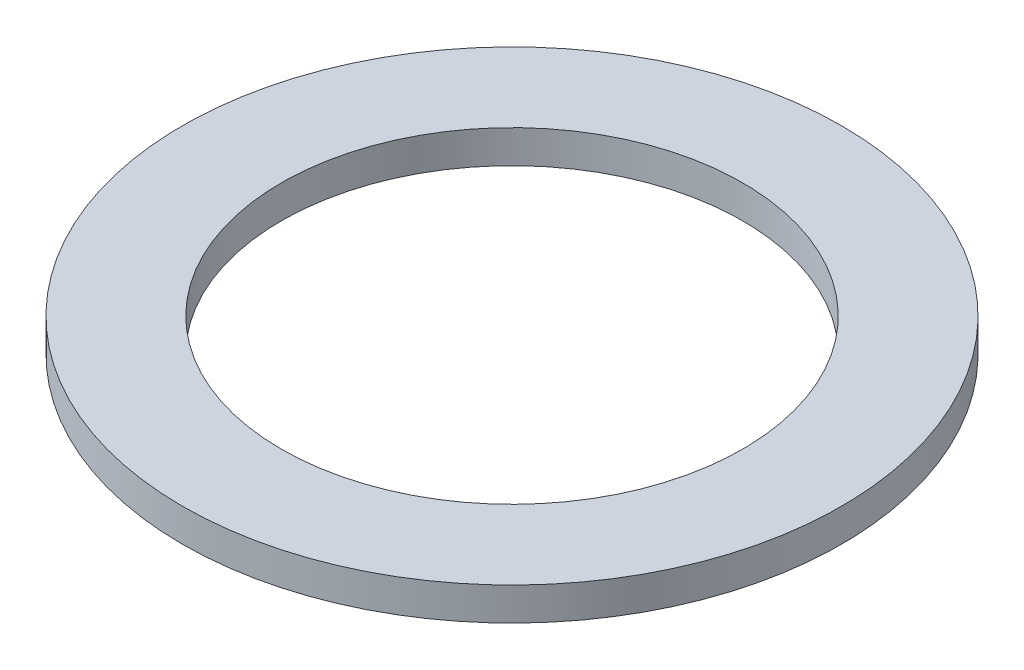
ISO-10303-21;
HEADER;
FILE_DESCRIPTION(('STEP AP214'),'2;1');
FILE_NAME('part.step','',(''),(''),'','','');
FILE_SCHEMA(('AUTOMOTIVE_DESIGN { 1 0 10303 214 1 1 1 1 }'));
ENDSEC;
DATA;
#1=APPLICATION_CONTEXT('core data for automotive mechanical design processes');
#2=APPLICATION_PROTOCOL_DEFINITION('international standard','automotive_design',2000,#1);
#3=PRODUCT_CONTEXT('',#1,'mechanical');
#4=PRODUCT('Part','Part','',(#3));
#5=PRODUCT_RELATED_PRODUCT_CATEGORY('part','',(#4));
#6=PRODUCT_DEFINITION_FORMATION('','',#4);
#7=PRODUCT_DEFINITION_CONTEXT('part definition',#1,'design');
#8=PRODUCT_DEFINITION('design','',#6,#7);
#9=PRODUCT_DEFINITION_SHAPE('','',#8);
#10=(LENGTH_UNIT() NAMED_UNIT(*) SI_UNIT(.MILLI.,.METRE.));
#11=(NAMED_UNIT(*) PLANE_ANGLE_UNIT() SI_UNIT($,.RADIAN.));
#12=(NAMED_UNIT(*) SI_UNIT($,.STERADIAN.) SOLID_ANGLE_UNIT());
#13=UNCERTAINTY_MEASURE_WITH_UNIT(LENGTH_MEASURE(1.E-05),#10,'distance_accuracy_value','');
#14=(GEOMETRIC_REPRESENTATION_CONTEXT(3) GLOBAL_UNCERTAINTY_ASSIGNED_CONTEXT((#13)) GLOBAL_UNIT_ASSIGNED_CONTEXT((#10,
#11,#12)) REPRESENTATION_CONTEXT('',''));
#15=CARTESIAN_POINT('',(0.,0.,0.));
#16=DIRECTION('',(0.,0.,1.));
#17=DIRECTION('',(1.,0.,0.));
#18=AXIS2_PLACEMENT_3D('',#15,#16,#17);
#19=CARTESIAN_POINT('',(0.,1.,0.));
#20=DIRECTION('',(0.,-1.,0.));
#21=DIRECTION('',(0.,0.,-1.));
#22=AXIS2_PLACEMENT_3D('',#19,#20,#21);
#23=CYLINDRICAL_SURFACE('',#22,10.);
#24=CARTESIAN_POINT('',(0.,1.,0.));
#25=DIRECTION('',(0.,1.,0.));
#26=DIRECTION('',(0.,0.,1.));
#27=AXIS2_PLACEMENT_3D('',#24,#25,#26);
#28=CIRCLE('',#27,10.);
#29=CARTESIAN_POINT('',(0.,1.,10.));
#30=VERTEX_POINT('',#29);
#31=EDGE_CURVE('E10',#30,#30,#28,.T.);
#32=ORIENTED_EDGE('',*,*,#31,.F.);
#33=EDGE_LOOP('',(#32));
#34=FACE_BOUND('',#33,.T.);
#35=CARTESIAN_POINT('',(0.,0.,0.));
#36=DIRECTION('',(0.,1.,0.));
#37=DIRECTION('',(0.,0.,1.));
#38=AXIS2_PLACEMENT_3D('',#35,#36,#37);
#39=CIRCLE('',#38,10.);
#40=CARTESIAN_POINT('',(0.,0.,10.));
#41=VERTEX_POINT('',#40);
#42=EDGE_CURVE('E33',#41,#41,#39,.T.);
#43=ORIENTED_EDGE('',*,*,#42,.T.);
#44=EDGE_LOOP('',(#43));
#45=FACE_BOUND('',#44,.T.);
#46=ADVANCED_FACE('F30',(#34,#45),#23,.T.);
#47=CARTESIAN_POINT('',(0.,1.,0.));
#48=DIRECTION('',(0.,1.,0.));
#49=DIRECTION('',(0.,0.,1.));
#50=AXIS2_PLACEMENT_3D('',#47,#48,#49);
#51=PLANE('',#50);
#52=CARTESIAN_POINT('',(0.,1.,0.));
#53=DIRECTION('',(0.,1.,0.));
#54=DIRECTION('',(0.,0.,1.));
#55=AXIS2_PLACEMENT_3D('',#52,#53,#54);
#56=CIRCLE('',#55,7.);
#57=CARTESIAN_POINT('',(0.,1.,7.));
#58=VERTEX_POINT('',#57);
#59=EDGE_CURVE('E42',#58,#58,#56,.T.);
#60=ORIENTED_EDGE('',*,*,#59,.F.);
#61=EDGE_LOOP('',(#60));
#62=FACE_BOUND('',#61,.T.);
#63=ORIENTED_EDGE('',*,*,#31,.T.);
#64=EDGE_LOOP('',(#63));
#65=FACE_BOUND('',#64,.T.);
#66=ADVANCED_FACE('F57',(#62,#65),#51,.T.);
#67=CARTESIAN_POINT('',(0.,0.,0.));
#68=DIRECTION('',(0.,1.,0.));
#69=DIRECTION('',(0.,0.,1.));
#70=AXIS2_PLACEMENT_3D('',#67,#68,#69);
#71=PLANE('',#70);
#72=CARTESIAN_POINT('',(0.,0.,0.));
#73=DIRECTION('',(0.,1.,0.));
#74=DIRECTION('',(0.,0.,1.));
#75=AXIS2_PLACEMENT_3D('',#72,#73,#74);
#76=CIRCLE('',#75,7.);
#77=CARTESIAN_POINT('',(0.,0.,7.));
#78=VERTEX_POINT('',#77);
#79=EDGE_CURVE('E40',#78,#78,#76,.T.);
#80=ORIENTED_EDGE('',*,*,#79,.T.);
#81=EDGE_LOOP('',(#80));
#82=FACE_BOUND('',#81,.T.);
#83=ORIENTED_EDGE('',*,*,#42,.F.);
#84=EDGE_LOOP('',(#83));
#85=FACE_BOUND('',#84,.T.);
#86=ADVANCED_FACE('F48',(#82,#85),#71,.F.);
#87=CARTESIAN_POINT('',(0.,0.,0.));
#88=DIRECTION('',(0.,1.,0.));
#89=DIRECTION('',(0.,0.,1.));
#90=AXIS2_PLACEMENT_3D('',#87,#88,#89);
#91=CYLINDRICAL_SURFACE('',#90,7.);
#92=ORIENTED_EDGE('',*,*,#79,.F.);
#93=EDGE_LOOP('',(#92));
#94=FACE_BOUND('',#93,.T.);
#95=ORIENTED_EDGE('',*,*,#59,.T.);
#96=EDGE_LOOP('',(#95));
#97=FACE_BOUND('',#96,.T.);
#98=ADVANCED_FACE('F51',(#94,#97),#91,.F.);
#99=CLOSED_SHELL('',(#46,#66,#86,#98));
#100=MANIFOLD_SOLID_BREP('B2',#99);
#101=ADVANCED_BREP_SHAPE_REPRESENTATION('',(#18,#100),#14);
#102=SHAPE_DEFINITION_REPRESENTATION(#9,#101);
ENDSEC;
END-ISO-10303-21;
